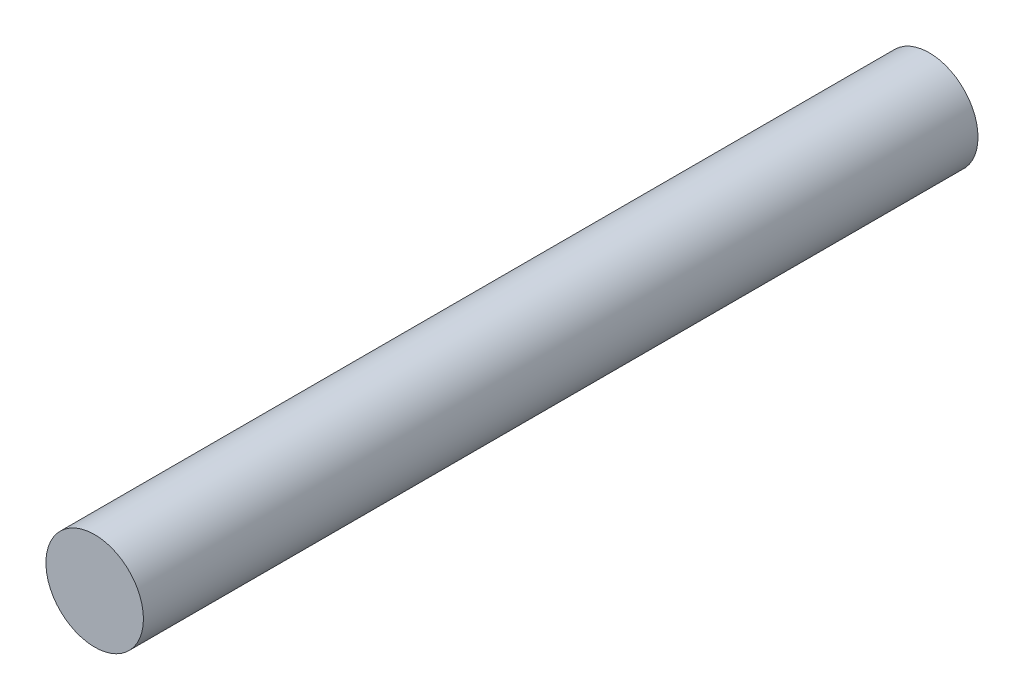
ISO-10303-21;
HEADER;
FILE_DESCRIPTION(('STEP AP214'),'2;1');
FILE_NAME('part.step','',(''),(''),'','','');
FILE_SCHEMA(('AUTOMOTIVE_DESIGN { 1 0 10303 214 1 1 1 1 }'));
ENDSEC;
DATA;
#1=APPLICATION_CONTEXT('core data for automotive mechanical design processes');
#2=APPLICATION_PROTOCOL_DEFINITION('international standard','automotive_design',2000,#1);
#3=PRODUCT_CONTEXT('',#1,'mechanical');
#4=PRODUCT('Part','Part','',(#3));
#5=PRODUCT_RELATED_PRODUCT_CATEGORY('part','',(#4));
#6=PRODUCT_DEFINITION_FORMATION('','',#4);
#7=PRODUCT_DEFINITION_CONTEXT('part definition',#1,'design');
#8=PRODUCT_DEFINITION('design','',#6,#7);
#9=PRODUCT_DEFINITION_SHAPE('','',#8);
#10=(LENGTH_UNIT() NAMED_UNIT(*) SI_UNIT(.MILLI.,.METRE.));
#11=(NAMED_UNIT(*) PLANE_ANGLE_UNIT() SI_UNIT($,.RADIAN.));
#12=(NAMED_UNIT(*) SI_UNIT($,.STERADIAN.) SOLID_ANGLE_UNIT());
#13=UNCERTAINTY_MEASURE_WITH_UNIT(LENGTH_MEASURE(1.E-05),#10,'distance_accuracy_value','');
#14=(GEOMETRIC_REPRESENTATION_CONTEXT(3) GLOBAL_UNCERTAINTY_ASSIGNED_CONTEXT((#13)) GLOBAL_UNIT_ASSIGNED_CONTEXT((#10,
#11,#12)) REPRESENTATION_CONTEXT('',''));
#15=CARTESIAN_POINT('',(0.,0.,0.));
#16=DIRECTION('',(0.,0.,1.));
#17=DIRECTION('',(1.,0.,0.));
#18=AXIS2_PLACEMENT_3D('',#15,#16,#17);
#19=CARTESIAN_POINT('',(0.,0.,47.5));
#20=DIRECTION('',(0.,0.,-1.));
#21=DIRECTION('',(-1.,0.,0.));
#22=AXIS2_PLACEMENT_3D('',#19,#20,#21);
#23=CYLINDRICAL_SURFACE('',#22,2.775);
#24=CARTESIAN_POINT('',(0.,0.,47.5));
#25=DIRECTION('',(0.,0.,1.));
#26=DIRECTION('',(1.,0.,0.));
#27=AXIS2_PLACEMENT_3D('',#24,#25,#26);
#28=CIRCLE('',#27,2.775);
#29=CARTESIAN_POINT('',(2.775,0.,47.5));
#30=VERTEX_POINT('',#29);
#31=EDGE_CURVE('E10',#30,#30,#28,.T.);
#32=ORIENTED_EDGE('',*,*,#31,.F.);
#33=EDGE_LOOP('',(#32));
#34=FACE_BOUND('',#33,.T.);
#35=CARTESIAN_POINT('',(0.,0.,0.));
#36=DIRECTION('',(0.,0.,1.));
#37=DIRECTION('',(1.,0.,0.));
#38=AXIS2_PLACEMENT_3D('',#35,#36,#37);
#39=CIRCLE('',#38,2.775);
#40=CARTESIAN_POINT('',(2.775,0.,0.));
#41=VERTEX_POINT('',#40);
#42=EDGE_CURVE('E40',#41,#41,#39,.T.);
#43=ORIENTED_EDGE('',*,*,#42,.T.);
#44=EDGE_LOOP('',(#43));
#45=FACE_BOUND('',#44,.T.);
#46=ADVANCED_FACE('F37',(#34,#45),#23,.T.);
#47=CARTESIAN_POINT('',(0.,0.,47.5));
#48=DIRECTION('',(0.,0.,1.));
#49=DIRECTION('',(1.,0.,0.));
#50=AXIS2_PLACEMENT_3D('',#47,#48,#49);
#51=PLANE('',#50);
#52=ORIENTED_EDGE('',*,*,#31,.T.);
#53=EDGE_LOOP('',(#52));
#54=FACE_BOUND('',#53,.T.);
#55=ADVANCED_FACE('F54',(#54),#51,.T.);
#56=CARTESIAN_POINT('',(0.,0.,0.));
#57=DIRECTION('',(0.,0.,1.));
#58=DIRECTION('',(1.,0.,0.));
#59=AXIS2_PLACEMENT_3D('',#56,#57,#58);
#60=PLANE('',#59);
#61=ORIENTED_EDGE('',*,*,#42,.F.);
#62=EDGE_LOOP('',(#61));
#63=FACE_BOUND('',#62,.T.);
#64=ADVANCED_FACE('F52',(#63),#60,.F.);
#65=CLOSED_SHELL('',(#46,#55,#64));
#66=MANIFOLD_SOLID_BREP('B2',#65);
#67=ADVANCED_BREP_SHAPE_REPRESENTATION('',(#18,#66),#14);
#68=SHAPE_DEFINITION_REPRESENTATION(#9,#67);
ENDSEC;
END-ISO-10303-21;
